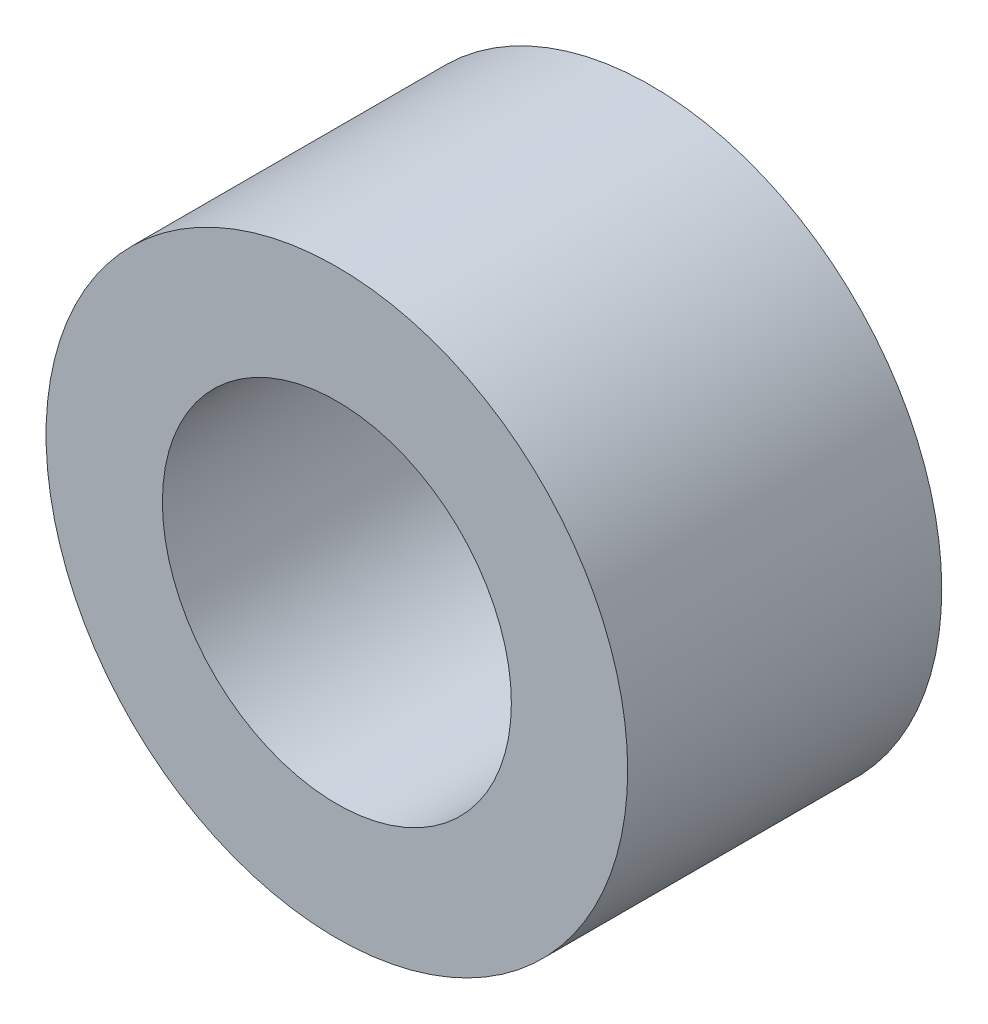
ISO-10303-21;
HEADER;
FILE_DESCRIPTION(('STEP AP214'),'2;1');
FILE_NAME('part.step','',(''),(''),'','','');
FILE_SCHEMA(('AUTOMOTIVE_DESIGN { 1 0 10303 214 1 1 1 1 }'));
ENDSEC;
DATA;
#1=APPLICATION_CONTEXT('core data for automotive mechanical design processes');
#2=APPLICATION_PROTOCOL_DEFINITION('international standard','automotive_design',2000,#1);
#3=PRODUCT_CONTEXT('',#1,'mechanical');
#4=PRODUCT('Part','Part','',(#3));
#5=PRODUCT_RELATED_PRODUCT_CATEGORY('part','',(#4));
#6=PRODUCT_DEFINITION_FORMATION('','',#4);
#7=PRODUCT_DEFINITION_CONTEXT('part definition',#1,'design');
#8=PRODUCT_DEFINITION('design','',#6,#7);
#9=PRODUCT_DEFINITION_SHAPE('','',#8);
#10=(LENGTH_UNIT() NAMED_UNIT(*) SI_UNIT(.MILLI.,.METRE.));
#11=(NAMED_UNIT(*) PLANE_ANGLE_UNIT() SI_UNIT($,.RADIAN.));
#12=(NAMED_UNIT(*) SI_UNIT($,.STERADIAN.) SOLID_ANGLE_UNIT());
#13=UNCERTAINTY_MEASURE_WITH_UNIT(LENGTH_MEASURE(1.E-05),#10,'distance_accuracy_value','');
#14=(GEOMETRIC_REPRESENTATION_CONTEXT(3) GLOBAL_UNCERTAINTY_ASSIGNED_CONTEXT((#13)) GLOBAL_UNIT_ASSIGNED_CONTEXT((#10,
#11,#12)) REPRESENTATION_CONTEXT('',''));
#15=CARTESIAN_POINT('',(0.,0.,0.));
#16=DIRECTION('',(0.,0.,1.));
#17=DIRECTION('',(1.,0.,0.));
#18=AXIS2_PLACEMENT_3D('',#15,#16,#17);
#19=CARTESIAN_POINT('',(0.,0.,5.4));
#20=DIRECTION('',(0.,0.,1.));
#21=DIRECTION('',(1.,0.,0.));
#22=AXIS2_PLACEMENT_3D('',#19,#20,#21);
#23=PLANE('',#22);
#24=CARTESIAN_POINT('',(0.,0.,5.4));
#25=DIRECTION('',(0.,0.,1.));
#26=DIRECTION('',(1.,0.,0.));
#27=AXIS2_PLACEMENT_3D('',#24,#25,#26);
#28=CIRCLE('',#27,5.);
#29=CARTESIAN_POINT('',(5.,0.,5.4));
#30=VERTEX_POINT('',#29);
#31=EDGE_CURVE('E10',#30,#30,#28,.T.);
#32=ORIENTED_EDGE('',*,*,#31,.T.);
#33=EDGE_LOOP('',(#32));
#34=FACE_BOUND('',#33,.T.);
#35=CARTESIAN_POINT('',(0.,0.,5.4));
#36=DIRECTION('',(0.,0.,1.));
#37=DIRECTION('',(1.,0.,0.));
#38=AXIS2_PLACEMENT_3D('',#35,#36,#37);
#39=CIRCLE('',#38,3.);
#40=CARTESIAN_POINT('',(3.,0.,5.4));
#41=VERTEX_POINT('',#40);
#42=EDGE_CURVE('E43',#41,#41,#39,.T.);
#43=ORIENTED_EDGE('',*,*,#42,.F.);
#44=EDGE_LOOP('',(#43));
#45=FACE_BOUND('',#44,.T.);
#46=ADVANCED_FACE('F32',(#34,#45),#23,.T.);
#47=CARTESIAN_POINT('',(0.,0.,0.));
#48=DIRECTION('',(0.,0.,1.));
#49=DIRECTION('',(1.,0.,0.));
#50=AXIS2_PLACEMENT_3D('',#47,#48,#49);
#51=PLANE('',#50);
#52=CARTESIAN_POINT('',(0.,0.,0.));
#53=DIRECTION('',(0.,0.,1.));
#54=DIRECTION('',(1.,0.,0.));
#55=AXIS2_PLACEMENT_3D('',#52,#53,#54);
#56=CIRCLE('',#55,5.);
#57=CARTESIAN_POINT('',(5.,0.,0.));
#58=VERTEX_POINT('',#57);
#59=EDGE_CURVE('E36',#58,#58,#56,.T.);
#60=ORIENTED_EDGE('',*,*,#59,.F.);
#61=EDGE_LOOP('',(#60));
#62=FACE_BOUND('',#61,.T.);
#63=CARTESIAN_POINT('',(0.,0.,0.));
#64=DIRECTION('',(0.,0.,1.));
#65=DIRECTION('',(1.,0.,0.));
#66=AXIS2_PLACEMENT_3D('',#63,#64,#65);
#67=CIRCLE('',#66,3.);
#68=CARTESIAN_POINT('',(3.,0.,0.));
#69=VERTEX_POINT('',#68);
#70=EDGE_CURVE('E45',#69,#69,#67,.T.);
#71=ORIENTED_EDGE('',*,*,#70,.T.);
#72=EDGE_LOOP('',(#71));
#73=FACE_BOUND('',#72,.T.);
#74=ADVANCED_FACE('F55',(#62,#73),#51,.F.);
#75=CARTESIAN_POINT('',(0.,0.,5.4));
#76=DIRECTION('',(0.,0.,-1.));
#77=DIRECTION('',(-1.,0.,0.));
#78=AXIS2_PLACEMENT_3D('',#75,#76,#77);
#79=CYLINDRICAL_SURFACE('',#78,5.);
#80=ORIENTED_EDGE('',*,*,#31,.F.);
#81=EDGE_LOOP('',(#80));
#82=FACE_BOUND('',#81,.T.);
#83=ORIENTED_EDGE('',*,*,#59,.T.);
#84=EDGE_LOOP('',(#83));
#85=FACE_BOUND('',#84,.T.);
#86=ADVANCED_FACE('F34',(#82,#85),#79,.T.);
#87=CARTESIAN_POINT('',(0.,0.,5.4));
#88=DIRECTION('',(0.,0.,-1.));
#89=DIRECTION('',(-1.,0.,0.));
#90=AXIS2_PLACEMENT_3D('',#87,#88,#89);
#91=CYLINDRICAL_SURFACE('',#90,3.);
#92=ORIENTED_EDGE('',*,*,#42,.T.);
#93=EDGE_LOOP('',(#92));
#94=FACE_BOUND('',#93,.T.);
#95=ORIENTED_EDGE('',*,*,#70,.F.);
#96=EDGE_LOOP('',(#95));
#97=FACE_BOUND('',#96,.T.);
#98=ADVANCED_FACE('F51',(#94,#97),#91,.F.);
#99=CLOSED_SHELL('',(#46,#74,#86,#98));
#100=MANIFOLD_SOLID_BREP('B2',#99);
#101=ADVANCED_BREP_SHAPE_REPRESENTATION('',(#18,#100),#14);
#102=SHAPE_DEFINITION_REPRESENTATION(#9,#101);
ENDSEC;
END-ISO-10303-21;
